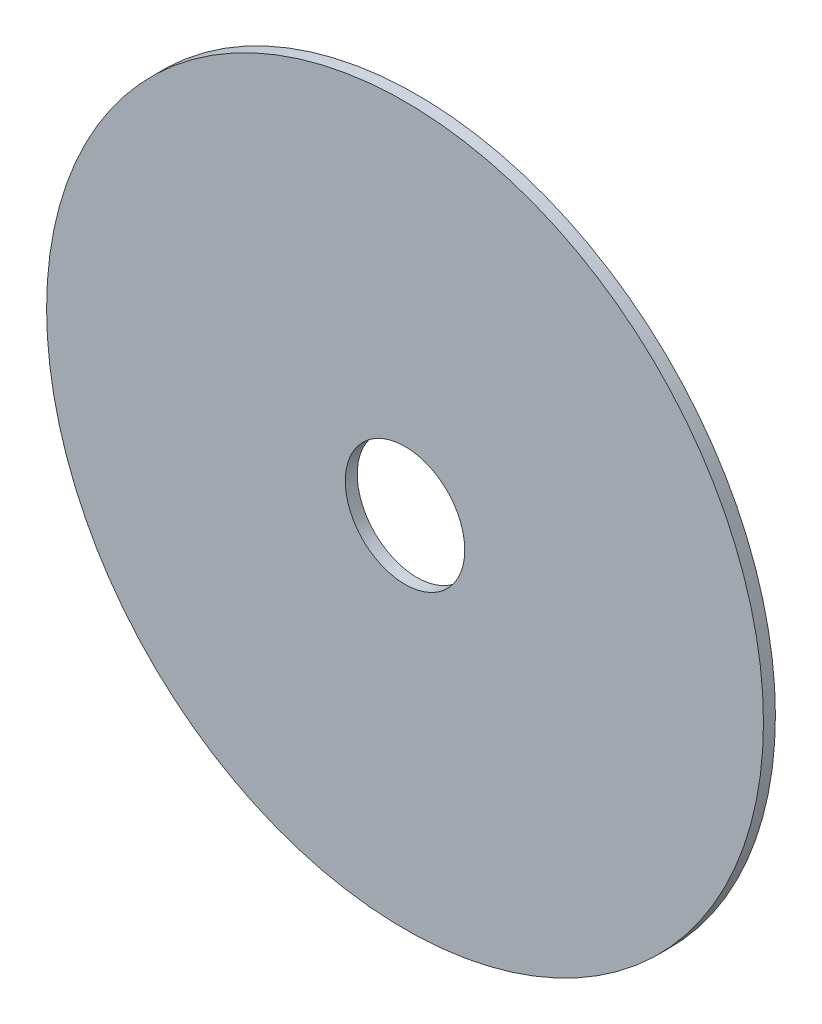
ISO-10303-21;
HEADER;
FILE_DESCRIPTION(('STEP AP214'),'2;1');
FILE_NAME('part.step','',(''),(''),'','','');
FILE_SCHEMA(('AUTOMOTIVE_DESIGN { 1 0 10303 214 1 1 1 1 }'));
ENDSEC;
DATA;
#1=APPLICATION_CONTEXT('core data for automotive mechanical design processes');
#2=APPLICATION_PROTOCOL_DEFINITION('international standard','automotive_design',2000,#1);
#3=PRODUCT_CONTEXT('',#1,'mechanical');
#4=PRODUCT('Part','Part','',(#3));
#5=PRODUCT_RELATED_PRODUCT_CATEGORY('part','',(#4));
#6=PRODUCT_DEFINITION_FORMATION('','',#4);
#7=PRODUCT_DEFINITION_CONTEXT('part definition',#1,'design');
#8=PRODUCT_DEFINITION('design','',#6,#7);
#9=PRODUCT_DEFINITION_SHAPE('','',#8);
#10=(LENGTH_UNIT() NAMED_UNIT(*) SI_UNIT(.MILLI.,.METRE.));
#11=(NAMED_UNIT(*) PLANE_ANGLE_UNIT() SI_UNIT($,.RADIAN.));
#12=(NAMED_UNIT(*) SI_UNIT($,.STERADIAN.) SOLID_ANGLE_UNIT());
#13=UNCERTAINTY_MEASURE_WITH_UNIT(LENGTH_MEASURE(1.E-05),#10,'distance_accuracy_value','');
#14=(GEOMETRIC_REPRESENTATION_CONTEXT(3) GLOBAL_UNCERTAINTY_ASSIGNED_CONTEXT((#13)) GLOBAL_UNIT_ASSIGNED_CONTEXT((#10,
#11,#12)) REPRESENTATION_CONTEXT('',''));
#15=CARTESIAN_POINT('',(0.,0.,0.));
#16=DIRECTION('',(0.,0.,1.));
#17=DIRECTION('',(1.,0.,0.));
#18=AXIS2_PLACEMENT_3D('',#15,#16,#17);
#19=CARTESIAN_POINT('',(0.,0.,1.));
#20=DIRECTION('',(0.,0.,-1.));
#21=DIRECTION('',(-1.,0.,0.));
#22=AXIS2_PLACEMENT_3D('',#19,#20,#21);
#23=CYLINDRICAL_SURFACE('',#22,30.);
#24=CARTESIAN_POINT('',(0.,0.,1.));
#25=DIRECTION('',(0.,0.,1.));
#26=DIRECTION('',(1.,0.,0.));
#27=AXIS2_PLACEMENT_3D('',#24,#25,#26);
#28=CIRCLE('',#27,30.);
#29=CARTESIAN_POINT('',(30.,0.,1.));
#30=VERTEX_POINT('',#29);
#31=EDGE_CURVE('E10',#30,#30,#28,.T.);
#32=ORIENTED_EDGE('',*,*,#31,.F.);
#33=EDGE_LOOP('',(#32));
#34=FACE_BOUND('',#33,.T.);
#35=CARTESIAN_POINT('',(0.,0.,0.));
#36=DIRECTION('',(0.,0.,1.));
#37=DIRECTION('',(1.,0.,0.));
#38=AXIS2_PLACEMENT_3D('',#35,#36,#37);
#39=CIRCLE('',#38,30.);
#40=CARTESIAN_POINT('',(30.,0.,0.));
#41=VERTEX_POINT('',#40);
#42=EDGE_CURVE('E38',#41,#41,#39,.T.);
#43=ORIENTED_EDGE('',*,*,#42,.T.);
#44=EDGE_LOOP('',(#43));
#45=FACE_BOUND('',#44,.T.);
#46=ADVANCED_FACE('F31',(#34,#45),#23,.T.);
#47=CARTESIAN_POINT('',(0.,0.,1.));
#48=DIRECTION('',(0.,0.,1.));
#49=DIRECTION('',(1.,0.,0.));
#50=AXIS2_PLACEMENT_3D('',#47,#48,#49);
#51=PLANE('',#50);
#52=CARTESIAN_POINT('',(0.,0.,1.));
#53=DIRECTION('',(0.,0.,1.));
#54=DIRECTION('',(1.,0.,0.));
#55=AXIS2_PLACEMENT_3D('',#52,#53,#54);
#56=CIRCLE('',#55,5.);
#57=CARTESIAN_POINT('',(5.,0.,1.));
#58=VERTEX_POINT('',#57);
#59=EDGE_CURVE('E44',#58,#58,#56,.T.);
#60=ORIENTED_EDGE('',*,*,#59,.F.);
#61=EDGE_LOOP('',(#60));
#62=FACE_BOUND('',#61,.T.);
#63=ORIENTED_EDGE('',*,*,#31,.T.);
#64=EDGE_LOOP('',(#63));
#65=FACE_BOUND('',#64,.T.);
#66=ADVANCED_FACE('F60',(#62,#65),#51,.T.);
#67=CARTESIAN_POINT('',(0.,0.,0.));
#68=DIRECTION('',(0.,0.,1.));
#69=DIRECTION('',(1.,0.,0.));
#70=AXIS2_PLACEMENT_3D('',#67,#68,#69);
#71=PLANE('',#70);
#72=CARTESIAN_POINT('',(0.,0.,0.));
#73=DIRECTION('',(0.,0.,1.));
#74=DIRECTION('',(1.,0.,0.));
#75=AXIS2_PLACEMENT_3D('',#72,#73,#74);
#76=CIRCLE('',#75,5.);
#77=CARTESIAN_POINT('',(5.,0.,0.));
#78=VERTEX_POINT('',#77);
#79=EDGE_CURVE('E34',#78,#78,#76,.T.);
#80=ORIENTED_EDGE('',*,*,#79,.T.);
#81=EDGE_LOOP('',(#80));
#82=FACE_BOUND('',#81,.T.);
#83=ORIENTED_EDGE('',*,*,#42,.F.);
#84=EDGE_LOOP('',(#83));
#85=FACE_BOUND('',#84,.T.);
#86=ADVANCED_FACE('F51',(#82,#85),#71,.F.);
#87=CARTESIAN_POINT('',(0.,0.,-3.));
#88=DIRECTION('',(0.,0.,1.));
#89=DIRECTION('',(1.,0.,0.));
#90=AXIS2_PLACEMENT_3D('',#87,#88,#89);
#91=CYLINDRICAL_SURFACE('',#90,5.);
#92=ORIENTED_EDGE('',*,*,#59,.T.);
#93=EDGE_LOOP('',(#92));
#94=FACE_BOUND('',#93,.T.);
#95=ORIENTED_EDGE('',*,*,#79,.F.);
#96=EDGE_LOOP('',(#95));
#97=FACE_BOUND('',#96,.T.);
#98=ADVANCED_FACE('F54',(#94,#97),#91,.F.);
#99=CLOSED_SHELL('',(#46,#66,#86,#98));
#100=MANIFOLD_SOLID_BREP('B2',#99);
#101=ADVANCED_BREP_SHAPE_REPRESENTATION('',(#18,#100),#14);
#102=SHAPE_DEFINITION_REPRESENTATION(#9,#101);
ENDSEC;
END-ISO-10303-21;
